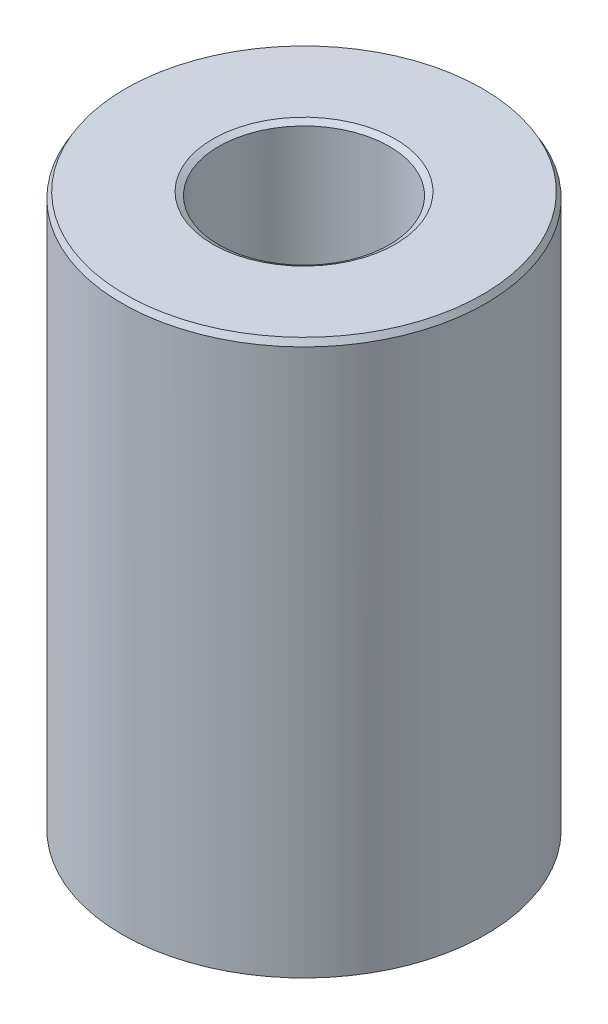
ISO-10303-21;
HEADER;
FILE_DESCRIPTION(('STEP AP214'),'2;1');
FILE_NAME('part.step','',(''),(''),'','','');
FILE_SCHEMA(('AUTOMOTIVE_DESIGN { 1 0 10303 214 1 1 1 1 }'));
ENDSEC;
DATA;
#1=APPLICATION_CONTEXT('core data for automotive mechanical design processes');
#2=APPLICATION_PROTOCOL_DEFINITION('international standard','automotive_design',2000,#1);
#3=PRODUCT_CONTEXT('',#1,'mechanical');
#4=PRODUCT('Part','Part','',(#3));
#5=PRODUCT_RELATED_PRODUCT_CATEGORY('part','',(#4));
#6=PRODUCT_DEFINITION_FORMATION('','',#4);
#7=PRODUCT_DEFINITION_CONTEXT('part definition',#1,'design');
#8=PRODUCT_DEFINITION('design','',#6,#7);
#9=PRODUCT_DEFINITION_SHAPE('','',#8);
#10=(LENGTH_UNIT() NAMED_UNIT(*) SI_UNIT(.MILLI.,.METRE.));
#11=(NAMED_UNIT(*) PLANE_ANGLE_UNIT() SI_UNIT($,.RADIAN.));
#12=(NAMED_UNIT(*) SI_UNIT($,.STERADIAN.) SOLID_ANGLE_UNIT());
#13=UNCERTAINTY_MEASURE_WITH_UNIT(LENGTH_MEASURE(1.E-05),#10,'distance_accuracy_value','');
#14=(GEOMETRIC_REPRESENTATION_CONTEXT(3) GLOBAL_UNCERTAINTY_ASSIGNED_CONTEXT((#13)) GLOBAL_UNIT_ASSIGNED_CONTEXT((#10,
#11,#12)) REPRESENTATION_CONTEXT('',''));
#15=CARTESIAN_POINT('',(0.,0.,0.));
#16=DIRECTION('',(0.,0.,1.));
#17=DIRECTION('',(1.,0.,0.));
#18=AXIS2_PLACEMENT_3D('',#15,#16,#17);
#19=CARTESIAN_POINT('',(0.,106.971525786807,0.));
#20=DIRECTION('',(0.,-1.,0.));
#21=DIRECTION('',(0.,0.,-1.));
#22=AXIS2_PLACEMENT_3D('',#19,#20,#21);
#23=CYLINDRICAL_SURFACE('',#22,35.);
#24=CARTESIAN_POINT('',(0.,0.659196718033453,0.));
#25=DIRECTION('',(0.,1.,0.));
#26=DIRECTION('',(0.,0.,1.));
#27=AXIS2_PLACEMENT_3D('',#24,#25,#26);
#28=CIRCLE('',#27,35.);
#29=CARTESIAN_POINT('',(0.,0.659196718033453,-35.));
#30=VERTEX_POINT('',#29);
#31=EDGE_CURVE('E10',#30,#30,#28,.T.);
#32=CARTESIAN_POINT('',(0.,105.829763578991,0.));
#33=DIRECTION('',(0.,1.,0.));
#34=DIRECTION('',(0.,0.,1.));
#35=AXIS2_PLACEMENT_3D('',#32,#33,#34);
#36=CIRCLE('',#35,35.);
#37=CARTESIAN_POINT('',(0.,105.829763578991,-35.));
#38=VERTEX_POINT('',#37);
#39=EDGE_CURVE('E50',#38,#38,#36,.F.);
#40=CARTESIAN_POINT('',(0.,0.659196718033453,-35.));
#41=CARTESIAN_POINT('',(0.,1.75472345616843,-35.));
#42=CARTESIAN_POINT('',(0.,2.8502501943034,-35.));
#43=CARTESIAN_POINT('',(0.,5.04130367057334,-35.));
#44=CARTESIAN_POINT('',(0.,6.13683040870831,-35.));
#45=CARTESIAN_POINT('',(0.,8.32788388497825,-35.));
#46=CARTESIAN_POINT('',(0.,9.42341062311322,-35.));
#47=CARTESIAN_POINT('',(0.,11.6144640993832,-35.));
#48=CARTESIAN_POINT('',(0.,12.7099908375181,-35.));
#49=CARTESIAN_POINT('',(0.,14.9010443137881,-35.));
#50=CARTESIAN_POINT('',(0.,15.9965710519231,-35.));
#51=CARTESIAN_POINT('',(0.,18.187624528193,-35.));
#52=CARTESIAN_POINT('',(0.,19.283151266328,-35.));
#53=CARTESIAN_POINT('',(0.,21.4742047425979,-35.));
#54=CARTESIAN_POINT('',(0.,22.5697314807329,-35.));
#55=CARTESIAN_POINT('',(0.,24.7607849570028,-35.));
#56=CARTESIAN_POINT('',(0.,25.8563116951378,-35.));
#57=CARTESIAN_POINT('',(0.,28.0473651714077,-35.));
#58=CARTESIAN_POINT('',(0.,29.1428919095427,-35.));
#59=CARTESIAN_POINT('',(0.,31.3339453858127,-35.));
#60=CARTESIAN_POINT('',(0.,32.4294721239476,-35.));
#61=CARTESIAN_POINT('',(0.,34.6205256002176,-35.));
#62=CARTESIAN_POINT('',(0.,35.7160523383525,-35.));
#63=CARTESIAN_POINT('',(0.,37.9071058146225,-35.));
#64=CARTESIAN_POINT('',(0.,39.0026325527575,-35.));
#65=CARTESIAN_POINT('',(0.,41.1936860290274,-35.));
#66=CARTESIAN_POINT('',(0.,42.2892127671624,-35.));
#67=CARTESIAN_POINT('',(0.,44.4802662434323,-35.));
#68=CARTESIAN_POINT('',(0.,45.5757929815673,-35.));
#69=CARTESIAN_POINT('',(0.,47.7668464578372,-35.));
#70=CARTESIAN_POINT('',(0.,48.8623731959722,-35.));
#71=CARTESIAN_POINT('',(0.,51.0534266722421,-35.));
#72=CARTESIAN_POINT('',(0.,52.1489534103771,-35.));
#73=CARTESIAN_POINT('',(0.,54.3400068866471,-35.));
#74=CARTESIAN_POINT('',(0.,55.435533624782,-35.));
#75=CARTESIAN_POINT('',(0.,57.626587101052,-35.));
#76=CARTESIAN_POINT('',(0.,58.7221138391869,-35.));
#77=CARTESIAN_POINT('',(0.,60.9131673154569,-35.));
#78=CARTESIAN_POINT('',(0.,62.0086940535919,-35.));
#79=CARTESIAN_POINT('',(0.,64.1997475298618,-35.));
#80=CARTESIAN_POINT('',(0.,65.2952742679968,-35.));
#81=CARTESIAN_POINT('',(0.,67.4863277442667,-35.));
#82=CARTESIAN_POINT('',(0.,68.5818544824017,-35.));
#83=CARTESIAN_POINT('',(0.,70.7729079586716,-35.));
#84=CARTESIAN_POINT('',(0.,71.8684346968066,-35.));
#85=CARTESIAN_POINT('',(0.,74.0594881730765,-35.));
#86=CARTESIAN_POINT('',(0.,75.1550149112115,-35.));
#87=CARTESIAN_POINT('',(0.,77.3460683874814,-35.));
#88=CARTESIAN_POINT('',(0.,78.4415951256164,-35.));
#89=CARTESIAN_POINT('',(0.,80.6326486018864,-35.));
#90=CARTESIAN_POINT('',(0.,81.7281753400213,-35.));
#91=CARTESIAN_POINT('',(0.,83.9192288162913,-35.));
#92=CARTESIAN_POINT('',(0.,85.0147555544263,-35.));
#93=CARTESIAN_POINT('',(0.,87.2058090306962,-35.));
#94=CARTESIAN_POINT('',(0.,88.3013357688312,-35.));
#95=CARTESIAN_POINT('',(0.,90.4923892451011,-35.));
#96=CARTESIAN_POINT('',(0.,91.5879159832361,-35.));
#97=CARTESIAN_POINT('',(0.,93.778969459506,-35.));
#98=CARTESIAN_POINT('',(0.,94.874496197641,-35.));
#99=CARTESIAN_POINT('',(0.,97.0655496739109,-35.));
#100=CARTESIAN_POINT('',(0.,98.1610764120459,-35.));
#101=CARTESIAN_POINT('',(0.,100.352129888316,-35.));
#102=CARTESIAN_POINT('',(0.,101.447656626451,-35.));
#103=CARTESIAN_POINT('',(0.,103.638710102721,-35.));
#104=CARTESIAN_POINT('',(0.,104.734236840856,-35.));
#105=CARTESIAN_POINT('',(0.,105.829763578991,-35.));
#106=B_SPLINE_CURVE_WITH_KNOTS('',3,(#40,#41,#42,#43,#44,#45,#46,#47,#48,#49,#50,#51,#52,#53,
#54,#55,#56,#57,#58,#59,#60,#61,#62,#63,#64,#65,#66,#67,#68,#69,#70,#71,#72,#73,#74,#75,#76,#77,
#78,#79,#80,#81,#82,#83,#84,#85,#86,#87,#88,#89,#90,#91,#92,#93,#94,#95,#96,#97,#98,#99,#100,
#101,#102,#103,#104,#105),.UNSPECIFIED.,.F.,.F.,(4,2,2,2,2,2,2,2,2,2,2,2,2,2,2,2,2,2,2,2,2,2,2,
2,2,2,2,2,2,2,2,2,4),(0.,3.28658021440492,6.57316042880983,9.85974064321474,13.1463208576197,
16.4329010720246,19.7194812864295,23.0060615008344,26.2926417152393,29.5792219296442,
32.8658021440491,36.1523823584541,39.438962572859,42.7255427872639,46.0121230016688,
49.2987032160737,52.5852834304786,55.8718636448835,59.1584438592885,62.4450240736934,
65.7316042880983,69.0181845025032,72.3047647169081,75.591344931313,78.8779251457179,
82.1645053601229,85.4510855745278,88.7376657889327,92.0242460033376,95.3108262177425,
98.5974064321474,101.883986646552,105.170566860957),.UNSPECIFIED.);
#107=EDGE_CURVE('BSEAM39',#30,#38,#106,.T.);
#108=ORIENTED_EDGE('',*,*,#31,.T.);
#109=ORIENTED_EDGE('',*,*,#39,.T.);
#110=ORIENTED_EDGE('',*,*,#107,.T.);
#111=ORIENTED_EDGE('',*,*,#107,.F.);
#112=EDGE_LOOP('',(#108,#110,#109,#111));
#113=FACE_BOUND('',#112,.T.);
#114=ADVANCED_FACE('F39',(#113),#23,.T.);
#115=CARTESIAN_POINT('',(0.,106.971525786807,0.));
#116=DIRECTION('',(0.,1.,0.));
#117=DIRECTION('',(0.,0.,1.));
#118=AXIS2_PLACEMENT_3D('',#115,#116,#117);
#119=PLANE('',#118);
#120=CARTESIAN_POINT('',(0.,106.971525786807,0.));
#121=DIRECTION('',(0.,1.,0.));
#122=DIRECTION('',(0.,0.,1.));
#123=AXIS2_PLACEMENT_3D('',#120,#121,#122);
#124=CIRCLE('',#123,17.554913504919);
#125=CARTESIAN_POINT('',(0.,106.971525786807,17.554913504919));
#126=VERTEX_POINT('',#125);
#127=EDGE_CURVE('E58',#126,#126,#124,.F.);
#128=ORIENTED_EDGE('',*,*,#127,.T.);
#129=EDGE_LOOP('',(#128));
#130=FACE_BOUND('',#129,.T.);
#131=CARTESIAN_POINT('',(0.,106.971525786807,0.));
#132=DIRECTION('',(0.,1.,0.));
#133=DIRECTION('',(0.,0.,1.));
#134=AXIS2_PLACEMENT_3D('',#131,#132,#133);
#135=CIRCLE('',#134,34.3408032819667);
#136=CARTESIAN_POINT('',(0.,106.971525786807,-34.3408032819667));
#137=VERTEX_POINT('',#136);
#138=EDGE_CURVE('E61',#137,#137,#135,.T.);
#139=ORIENTED_EDGE('',*,*,#138,.T.);
#140=EDGE_LOOP('',(#139));
#141=FACE_BOUND('',#140,.T.);
#142=ADVANCED_FACE('F88',(#130,#141),#119,.T.);
#143=CARTESIAN_POINT('',(0.,0.,0.));
#144=DIRECTION('',(0.,1.,0.));
#145=DIRECTION('',(0.,0.,1.));
#146=AXIS2_PLACEMENT_3D('',#143,#144,#145);
#147=PLANE('',#146);
#148=CARTESIAN_POINT('',(0.,0.,0.));
#149=DIRECTION('',(0.,1.,0.));
#150=DIRECTION('',(0.,0.,1.));
#151=AXIS2_PLACEMENT_3D('',#148,#149,#150);
#152=CIRCLE('',#151,17.0723480151358);
#153=CARTESIAN_POINT('',(0.,0.,17.0723480151358));
#154=VERTEX_POINT('',#153);
#155=EDGE_CURVE('E51',#154,#154,#152,.T.);
#156=ORIENTED_EDGE('',*,*,#155,.T.);
#157=EDGE_LOOP('',(#156));
#158=FACE_BOUND('',#157,.T.);
#159=CARTESIAN_POINT('',(0.,0.,0.));
#160=DIRECTION('',(0.,1.,0.));
#161=DIRECTION('',(0.,0.,1.));
#162=AXIS2_PLACEMENT_3D('',#159,#160,#161);
#163=CIRCLE('',#162,33.8582377921834);
#164=CARTESIAN_POINT('',(0.,0.,33.8582377921834));
#165=VERTEX_POINT('',#164);
#166=EDGE_CURVE('E54',#165,#165,#163,.F.);
#167=ORIENTED_EDGE('',*,*,#166,.T.);
#168=EDGE_LOOP('',(#167));
#169=FACE_BOUND('',#168,.T.);
#170=ADVANCED_FACE('F83',(#158,#169),#147,.F.);
#171=CARTESIAN_POINT('',(0.,106.971525786807,0.));
#172=DIRECTION('',(0.,-1.,0.));
#173=DIRECTION('',(0.,0.,-1.));
#174=AXIS2_PLACEMENT_3D('',#171,#172,#173);
#175=CYLINDRICAL_SURFACE('',#174,16.4131512971024);
#176=CARTESIAN_POINT('',(0.,106.312329068774,0.));
#177=DIRECTION('',(0.,1.,0.));
#178=DIRECTION('',(0.,0.,1.));
#179=AXIS2_PLACEMENT_3D('',#176,#177,#178);
#180=CIRCLE('',#179,16.4131512971024);
#181=CARTESIAN_POINT('',(0.,106.312329068774,-16.4131512971024));
#182=VERTEX_POINT('',#181);
#183=EDGE_CURVE('E67',#182,#182,#180,.T.);
#184=CARTESIAN_POINT('',(0.,1.1417622078165,0.));
#185=DIRECTION('',(0.,1.,0.));
#186=DIRECTION('',(0.,0.,1.));
#187=AXIS2_PLACEMENT_3D('',#184,#185,#186);
#188=CIRCLE('',#187,16.4131512971024);
#189=CARTESIAN_POINT('',(0.,1.14176220781649,-16.4131512971024));
#190=VERTEX_POINT('',#189);
#191=EDGE_CURVE('E69',#190,#190,#188,.F.);
#192=CARTESIAN_POINT('',(0.,106.312329068774,-16.4131512971024));
#193=CARTESIAN_POINT('',(0.,105.216802330639,-16.4131512971024));
#194=CARTESIAN_POINT('',(0.,104.121275592504,-16.4131512971024));
#195=CARTESIAN_POINT('',(0.,101.930222116234,-16.4131512971024));
#196=CARTESIAN_POINT('',(0.,100.834695378099,-16.4131512971024));
#197=CARTESIAN_POINT('',(0.,98.6436419018289,-16.4131512971024));
#198=CARTESIAN_POINT('',(0.,97.5481151636939,-16.4131512971024));
#199=CARTESIAN_POINT('',(0.,95.357061687424,-16.4131512971024));
#200=CARTESIAN_POINT('',(0.,94.261534949289,-16.4131512971024));
#201=CARTESIAN_POINT('',(0.,92.070481473019,-16.4131512971024));
#202=CARTESIAN_POINT('',(0.,90.9749547348841,-16.4131512971024));
#203=CARTESIAN_POINT('',(0.,88.7839012586141,-16.4131512971024));
#204=CARTESIAN_POINT('',(0.,87.6883745204792,-16.4131512971024));
#205=CARTESIAN_POINT('',(0.,85.4973210442092,-16.4131512971024));
#206=CARTESIAN_POINT('',(0.,84.4017943060743,-16.4131512971024));
#207=CARTESIAN_POINT('',(0.,82.2107408298043,-16.4131512971024));
#208=CARTESIAN_POINT('',(0.,81.1152140916693,-16.4131512971024));
#209=CARTESIAN_POINT('',(0.,78.9241606153994,-16.4131512971024));
#210=CARTESIAN_POINT('',(0.,77.8286338772644,-16.4131512971024));
#211=CARTESIAN_POINT('',(0.,75.6375804009945,-16.4131512971024));
#212=CARTESIAN_POINT('',(0.,74.5420536628595,-16.4131512971024));
#213=CARTESIAN_POINT('',(0.,72.3510001865896,-16.4131512971024));
#214=CARTESIAN_POINT('',(0.,71.2554734484546,-16.4131512971024));
#215=CARTESIAN_POINT('',(0.,69.0644199721847,-16.4131512971024));
#216=CARTESIAN_POINT('',(0.,67.9688932340497,-16.4131512971024));
#217=CARTESIAN_POINT('',(0.,65.7778397577798,-16.4131512971024));
#218=CARTESIAN_POINT('',(0.,64.6823130196448,-16.4131512971024));
#219=CARTESIAN_POINT('',(0.,62.4912595433749,-16.4131512971024));
#220=CARTESIAN_POINT('',(0.,61.3957328052399,-16.4131512971024));
#221=CARTESIAN_POINT('',(0.,59.2046793289699,-16.4131512971024));
#222=CARTESIAN_POINT('',(0.,58.109152590835,-16.4131512971024));
#223=CARTESIAN_POINT('',(0.,55.918099114565,-16.4131512971024));
#224=CARTESIAN_POINT('',(0.,54.8225723764301,-16.4131512971024));
#225=CARTESIAN_POINT('',(0.,52.6315189001601,-16.4131512971024));
#226=CARTESIAN_POINT('',(0.,51.5359921620251,-16.4131512971024));
#227=CARTESIAN_POINT('',(0.,49.3449386857552,-16.4131512971024));
#228=CARTESIAN_POINT('',(0.,48.2494119476202,-16.4131512971024));
#229=CARTESIAN_POINT('',(0.,46.0583584713503,-16.4131512971024));
#230=CARTESIAN_POINT('',(0.,44.9628317332153,-16.4131512971024));
#231=CARTESIAN_POINT('',(0.,42.7717782569454,-16.4131512971024));
#232=CARTESIAN_POINT('',(0.,41.6762515188104,-16.4131512971024));
#233=CARTESIAN_POINT('',(0.,39.4851980425405,-16.4131512971024));
#234=CARTESIAN_POINT('',(0.,38.3896713044055,-16.4131512971024));
#235=CARTESIAN_POINT('',(0.,36.1986178281356,-16.4131512971024));
#236=CARTESIAN_POINT('',(0.,35.1030910900006,-16.4131512971024));
#237=CARTESIAN_POINT('',(0.,32.9120376137306,-16.4131512971024));
#238=CARTESIAN_POINT('',(0.,31.8165108755957,-16.4131512971024));
#239=CARTESIAN_POINT('',(0.,29.6254573993257,-16.4131512971024));
#240=CARTESIAN_POINT('',(0.,28.5299306611908,-16.4131512971024));
#241=CARTESIAN_POINT('',(0.,26.3388771849208,-16.4131512971024));
#242=CARTESIAN_POINT('',(0.,25.2433504467859,-16.4131512971024));
#243=CARTESIAN_POINT('',(0.,23.0522969705159,-16.4131512971024));
#244=CARTESIAN_POINT('',(0.,21.9567702323809,-16.4131512971024));
#245=CARTESIAN_POINT('',(0.,19.765716756111,-16.4131512971024));
#246=CARTESIAN_POINT('',(0.,18.670190017976,-16.4131512971024));
#247=CARTESIAN_POINT('',(0.,16.4791365417061,-16.4131512971024));
#248=CARTESIAN_POINT('',(0.,15.3836098035711,-16.4131512971024));
#249=CARTESIAN_POINT('',(0.,13.1925563273012,-16.4131512971024));
#250=CARTESIAN_POINT('',(0.,12.0970295891662,-16.4131512971024));
#251=CARTESIAN_POINT('',(0.,9.90597611289626,-16.4131512971024));
#252=CARTESIAN_POINT('',(0.,8.8104493747613,-16.4131512971024));
#253=CARTESIAN_POINT('',(0.,6.61939589849136,-16.4131512971024));
#254=CARTESIAN_POINT('',(0.,5.52386916035639,-16.4131512971024));
#255=CARTESIAN_POINT('',(0.,3.33281568408644,-16.4131512971024));
#256=CARTESIAN_POINT('',(0.,2.23728894595147,-16.4131512971024));
#257=CARTESIAN_POINT('',(0.,1.14176220781649,-16.4131512971024));
#258=B_SPLINE_CURVE_WITH_KNOTS('',3,(#192,#193,#194,#195,#196,#197,#198,#199,#200,#201,#202,
#203,#204,#205,#206,#207,#208,#209,#210,#211,#212,#213,#214,#215,#216,#217,#218,#219,#220,#221,
#222,#223,#224,#225,#226,#227,#228,#229,#230,#231,#232,#233,#234,#235,#236,#237,#238,#239,#240,
#241,#242,#243,#244,#245,#246,#247,#248,#249,#250,#251,#252,#253,#254,#255,#256,#257),
.UNSPECIFIED.,.F.,.F.,(4,2,2,2,2,2,2,2,2,2,2,2,2,2,2,2,2,2,2,2,2,2,2,2,2,2,2,2,2,2,2,2,4),(0.,
3.28658021440492,6.57316042880983,9.85974064321474,13.1463208576197,16.4329010720246,
19.7194812864295,23.0060615008344,26.2926417152393,29.5792219296442,32.8658021440491,
36.152382358454,39.4389625728589,42.7255427872639,46.0121230016688,49.2987032160737,
52.5852834304786,55.8718636448835,59.1584438592884,62.4450240736933,65.7316042880982,
69.0181845025032,72.3047647169081,75.591344931313,78.8779251457179,82.1645053601228,
85.4510855745277,88.7376657889326,92.0242460033375,95.3108262177424,98.5974064321473,
101.883986646552,105.170566860957),.UNSPECIFIED.);
#259=EDGE_CURVE('BSEAM71',#182,#190,#258,.T.);
#260=ORIENTED_EDGE('',*,*,#183,.T.);
#261=ORIENTED_EDGE('',*,*,#191,.T.);
#262=ORIENTED_EDGE('',*,*,#259,.T.);
#263=ORIENTED_EDGE('',*,*,#259,.F.);
#264=EDGE_LOOP('',(#260,#262,#261,#263));
#265=FACE_BOUND('',#264,.T.);
#266=ADVANCED_FACE('F71',(#265),#175,.F.);
#267=CARTESIAN_POINT('',(0.,106.312329068774,0.));
#268=DIRECTION('',(0.,1.,0.));
#269=DIRECTION('',(0.,0.,1.));
#270=AXIS2_PLACEMENT_3D('',#267,#268,#269);
#271=CONICAL_SURFACE('',#270,16.4131512971024,1.0471975511966);
#272=ORIENTED_EDGE('',*,*,#127,.F.);
#273=EDGE_LOOP('',(#272));
#274=FACE_BOUND('',#273,.T.);
#275=ORIENTED_EDGE('',*,*,#183,.F.);
#276=EDGE_LOOP('',(#275));
#277=FACE_BOUND('',#276,.T.);
#278=ADVANCED_FACE('F77',(#274,#277),#271,.F.);
#279=CARTESIAN_POINT('',(0.,0.,0.));
#280=DIRECTION('',(0.,-1.,0.));
#281=DIRECTION('',(0.,0.,-1.));
#282=AXIS2_PLACEMENT_3D('',#279,#280,#281);
#283=CONICAL_SURFACE('',#282,17.0723480151358,0.523598775598297);
#284=ORIENTED_EDGE('',*,*,#191,.F.);
#285=EDGE_LOOP('',(#284));
#286=FACE_BOUND('',#285,.T.);
#287=ORIENTED_EDGE('',*,*,#155,.F.);
#288=EDGE_LOOP('',(#287));
#289=FACE_BOUND('',#288,.T.);
#290=ADVANCED_FACE('F73',(#286,#289),#283,.F.);
#291=CARTESIAN_POINT('',(0.,0.659196718033453,0.));
#292=DIRECTION('',(0.,1.,0.));
#293=DIRECTION('',(0.,0.,1.));
#294=AXIS2_PLACEMENT_3D('',#291,#292,#293);
#295=CONICAL_SURFACE('',#294,35.,1.0471975511966);
#296=ORIENTED_EDGE('',*,*,#166,.F.);
#297=EDGE_LOOP('',(#296));
#298=FACE_BOUND('',#297,.T.);
#299=ORIENTED_EDGE('',*,*,#31,.F.);
#300=EDGE_LOOP('',(#299));
#301=FACE_BOUND('',#300,.T.);
#302=ADVANCED_FACE('F76',(#298,#301),#295,.T.);
#303=CARTESIAN_POINT('',(0.,106.971525786807,0.));
#304=DIRECTION('',(0.,-1.,0.));
#305=DIRECTION('',(0.,0.,-1.));
#306=AXIS2_PLACEMENT_3D('',#303,#304,#305);
#307=CONICAL_SURFACE('',#306,34.3408032819667,0.523598775598297);
#308=CARTESIAN_POINT('',(0.,105.829763578991,-35.));
#309=CARTESIAN_POINT('',(0.,105.841656935322,-34.9931333675205));
#310=CARTESIAN_POINT('',(0.,105.853550291654,-34.986266735041));
#311=CARTESIAN_POINT('',(0.,105.877337004316,-34.972533470082));
#312=CARTESIAN_POINT('',(0.,105.889230360648,-34.9656668376024));
#313=CARTESIAN_POINT('',(0.,105.913017073311,-34.9519335726434));
#314=CARTESIAN_POINT('',(0.,105.924910429642,-34.9450669401639));
#315=CARTESIAN_POINT('',(0.,105.948697142305,-34.9313336752049));
#316=CARTESIAN_POINT('',(0.,105.960590498636,-34.9244670427254));
#317=CARTESIAN_POINT('',(0.,105.984377211299,-34.9107337777663));
#318=CARTESIAN_POINT('',(0.,105.996270567631,-34.9038671452868));
#319=CARTESIAN_POINT('',(0.,106.020057280293,-34.8901338803278));
#320=CARTESIAN_POINT('',(0.,106.031950636625,-34.8832672478483));
#321=CARTESIAN_POINT('',(0.,106.055737349288,-34.8695339828893));
#322=CARTESIAN_POINT('',(0.,106.067630705619,-34.8626673504097));
#323=CARTESIAN_POINT('',(0.,106.091417418282,-34.8489340854507));
#324=CARTESIAN_POINT('',(0.,106.103310774613,-34.8420674529712));
#325=CARTESIAN_POINT('',(0.,106.127097487276,-34.8283341880122));
#326=CARTESIAN_POINT('',(0.,106.138990843608,-34.8214675555326));
#327=CARTESIAN_POINT('',(0.,106.16277755627,-34.8077342905736));
#328=CARTESIAN_POINT('',(0.,106.174670912602,-34.8008676580941));
#329=CARTESIAN_POINT('',(0.,106.198457625265,-34.7871343931351));
#330=CARTESIAN_POINT('',(0.,106.210350981596,-34.7802677606556));
#331=CARTESIAN_POINT('',(0.,106.234137694259,-34.7665344956965));
#332=CARTESIAN_POINT('',(0.,106.24603105059,-34.759667863217));
#333=CARTESIAN_POINT('',(0.,106.269817763253,-34.745934598258));
#334=CARTESIAN_POINT('',(0.,106.281711119585,-34.7390679657785));
#335=CARTESIAN_POINT('',(0.,106.305497832248,-34.7253347008195));
#336=CARTESIAN_POINT('',(0.,106.317391188579,-34.7184680683399));
#337=CARTESIAN_POINT('',(0.,106.341177901242,-34.7047348033809));
#338=CARTESIAN_POINT('',(0.,106.353071257573,-34.6978681709014));
#339=CARTESIAN_POINT('',(0.,106.376857970236,-34.6841349059424));
#340=CARTESIAN_POINT('',(0.,106.388751326568,-34.6772682734629));
#341=CARTESIAN_POINT('',(0.,106.41253803923,-34.6635350085038));
#342=CARTESIAN_POINT('',(0.,106.424431395562,-34.6566683760243));
#343=CARTESIAN_POINT('',(0.,106.448218108225,-34.6429351110653));
#344=CARTESIAN_POINT('',(0.,106.460111464556,-34.6360684785858));
#345=CARTESIAN_POINT('',(0.,106.483898177219,-34.6223352136267));
#346=CARTESIAN_POINT('',(0.,106.49579153355,-34.6154685811472));
#347=CARTESIAN_POINT('',(0.,106.519578246213,-34.6017353161882));
#348=CARTESIAN_POINT('',(0.,106.531471602545,-34.5948686837087));
#349=CARTESIAN_POINT('',(0.,106.555258315207,-34.5811354187497));
#350=CARTESIAN_POINT('',(0.,106.567151671539,-34.5742687862702));
#351=CARTESIAN_POINT('',(0.,106.590938384202,-34.5605355213111));
#352=CARTESIAN_POINT('',(0.,106.602831740533,-34.5536688888316));
#353=CARTESIAN_POINT('',(0.,106.626618453196,-34.5399356238726));
#354=CARTESIAN_POINT('',(0.,106.638511809527,-34.5330689913931));
#355=CARTESIAN_POINT('',(0.,106.66229852219,-34.519335726434));
#356=CARTESIAN_POINT('',(0.,106.674191878522,-34.5124690939545));
#357=CARTESIAN_POINT('',(0.,106.697978591184,-34.4987358289955));
#358=CARTESIAN_POINT('',(0.,106.709871947516,-34.491869196516));
#359=CARTESIAN_POINT('',(0.,106.733658660179,-34.4781359315569));
#360=CARTESIAN_POINT('',(0.,106.74555201651,-34.4712692990774));
#361=CARTESIAN_POINT('',(0.,106.769338729173,-34.4575360341184));
#362=CARTESIAN_POINT('',(0.,106.781232085504,-34.4506694016389));
#363=CARTESIAN_POINT('',(0.,106.805018798167,-34.4369361366799));
#364=CARTESIAN_POINT('',(0.,106.816912154499,-34.4300695042004));
#365=CARTESIAN_POINT('',(0.,106.840698867161,-34.4163362392413));
#366=CARTESIAN_POINT('',(0.,106.852592223493,-34.4094696067618));
#367=CARTESIAN_POINT('',(0.,106.876378936156,-34.3957363418028));
#368=CARTESIAN_POINT('',(0.,106.888272292487,-34.3888697093233));
#369=CARTESIAN_POINT('',(0.,106.91205900515,-34.3751364443642));
#370=CARTESIAN_POINT('',(0.,106.923952361481,-34.3682698118847));
#371=CARTESIAN_POINT('',(0.,106.947739074144,-34.3545365469257));
#372=CARTESIAN_POINT('',(0.,106.959632430476,-34.3476699144462));
#373=CARTESIAN_POINT('',(0.,106.971525786807,-34.3408032819667));
#374=B_SPLINE_CURVE_WITH_KNOTS('',3,(#308,#309,#310,#311,#312,#313,#314,#315,#316,#317,#318,
#319,#320,#321,#322,#323,#324,#325,#326,#327,#328,#329,#330,#331,#332,#333,#334,#335,#336,#337,
#338,#339,#340,#341,#342,#343,#344,#345,#346,#347,#348,#349,#350,#351,#352,#353,#354,#355,#356,
#357,#358,#359,#360,#361,#362,#363,#364,#365,#366,#367,#368,#369,#370,#371,#372,#373),
.UNSPECIFIED.,.F.,.F.,(4,2,2,2,2,2,2,2,2,2,2,2,2,2,2,2,2,2,2,2,2,2,2,2,2,2,2,2,2,2,2,2,4),(0.,
0.0411997948770745,0.082399589754161,0.123599384631248,0.164799179508334,0.205998974385417,
0.247198769262504,0.288398564139578,0.329598359016665,0.370798153893751,0.411997948770838,
0.453197743647921,0.494397538525007,0.535597333402082,0.576797128279168,0.617996923156255,
0.659196718033338,0.700396512910424,0.741596307787511,0.782796102664597,0.823995897541672,
0.865195692418754,0.906395487295841,0.947595282172927,0.988795077050014,1.0299948719271,
1.07119466680417,1.11239446168126,1.15359425655834,1.19479405143543,1.23599384631252,
1.2771936411896,1.31839343606669),.UNSPECIFIED.);
#375=EDGE_CURVE('BSEAM45',#38,#137,#374,.T.);
#376=ORIENTED_EDGE('',*,*,#39,.F.);
#377=ORIENTED_EDGE('',*,*,#138,.F.);
#378=ORIENTED_EDGE('',*,*,#375,.T.);
#379=ORIENTED_EDGE('',*,*,#375,.F.);
#380=EDGE_LOOP('',(#376,#378,#377,#379));
#381=FACE_BOUND('',#380,.T.);
#382=ADVANCED_FACE('F45',(#381),#307,.T.);
#383=CLOSED_SHELL('',(#114,#142,#170,#266,#278,#290,#302,#382));
#384=MANIFOLD_SOLID_BREP('B2',#383);
#385=ADVANCED_BREP_SHAPE_REPRESENTATION('',(#18,#384),#14);
#386=SHAPE_DEFINITION_REPRESENTATION(#9,#385);
ENDSEC;
END-ISO-10303-21;
